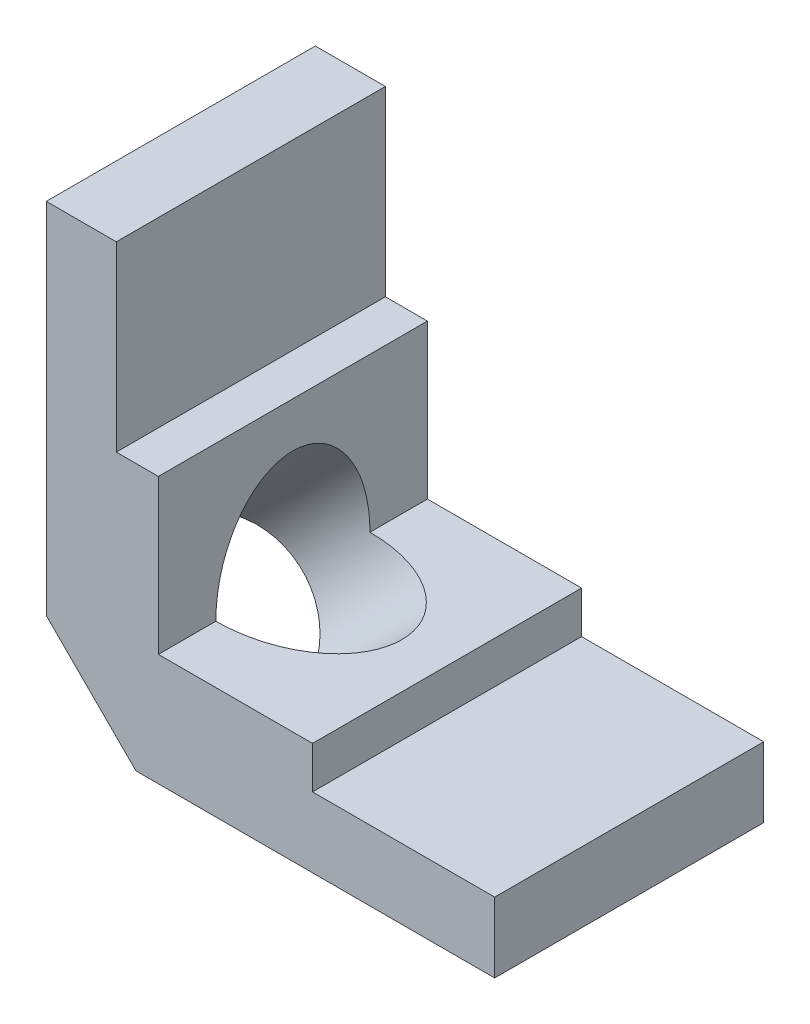
ISO-10303-21;
HEADER;
FILE_DESCRIPTION(('STEP AP214'),'2;1');
FILE_NAME('part.step','',(''),(''),'','','');
FILE_SCHEMA(('AUTOMOTIVE_DESIGN { 1 0 10303 214 1 1 1 1 }'));
ENDSEC;
DATA;
#1=APPLICATION_CONTEXT('core data for automotive mechanical design processes');
#2=APPLICATION_PROTOCOL_DEFINITION('international standard','automotive_design',2000,#1);
#3=PRODUCT_CONTEXT('',#1,'mechanical');
#4=PRODUCT('Part','Part','',(#3));
#5=PRODUCT_RELATED_PRODUCT_CATEGORY('part','',(#4));
#6=PRODUCT_DEFINITION_FORMATION('','',#4);
#7=PRODUCT_DEFINITION_CONTEXT('part definition',#1,'design');
#8=PRODUCT_DEFINITION('design','',#6,#7);
#9=PRODUCT_DEFINITION_SHAPE('','',#8);
#10=(LENGTH_UNIT() NAMED_UNIT(*) SI_UNIT(.MILLI.,.METRE.));
#11=(NAMED_UNIT(*) PLANE_ANGLE_UNIT() SI_UNIT($,.RADIAN.));
#12=(NAMED_UNIT(*) SI_UNIT($,.STERADIAN.) SOLID_ANGLE_UNIT());
#13=UNCERTAINTY_MEASURE_WITH_UNIT(LENGTH_MEASURE(1.E-05),#10,'distance_accuracy_value','');
#14=(GEOMETRIC_REPRESENTATION_CONTEXT(3) GLOBAL_UNCERTAINTY_ASSIGNED_CONTEXT((#13)) GLOBAL_UNIT_ASSIGNED_CONTEXT((#10,
#11,#12)) REPRESENTATION_CONTEXT('',''));
#15=CARTESIAN_POINT('',(0.,0.,0.));
#16=DIRECTION('',(0.,0.,1.));
#17=DIRECTION('',(1.,0.,0.));
#18=AXIS2_PLACEMENT_3D('',#15,#16,#17);
#19=CARTESIAN_POINT('',(5.07999999999997,0.,7.61999999999999));
#20=DIRECTION('',(0.707106781186549,0.707106781186546,0.));
#21=DIRECTION('',(-0.707106781186546,0.707106781186549,0.));
#22=AXIS2_PLACEMENT_3D('',#19,#20,#21);
#23=PLANE('',#22);
#24=CARTESIAN_POINT('',(2.53999999999998,2.54,0.));
#25=DIRECTION('',(0.707106781186549,0.707106781186546,0.));
#26=DIRECTION('',(-0.707106781186546,0.707106781186549,0.));
#27=AXIS2_PLACEMENT_3D('',#24,#25,#26);
#28=CIRCLE('',#27,4.36562499999999);
#29=CARTESIAN_POINT('',(0.,5.08000000000001,-2.48102431278391));
#30=VERTEX_POINT('',#29);
#31=CARTESIAN_POINT('',(5.07999999999997,0.,-2.48102431278394));
#32=VERTEX_POINT('',#31);
#33=EDGE_CURVE('E11',#30,#32,#28,.F.);
#34=ORIENTED_EDGE('',*,*,#33,.F.);
#35=DIRECTION('',(0.,0.,1.));
#36=VECTOR('',#35,1.);
#37=CARTESIAN_POINT('',(0.,5.08000000000002,7.62));
#38=LINE('',#37,#36);
#39=CARTESIAN_POINT('',(0.,5.08,-7.61999999999999));
#40=VERTEX_POINT('',#39);
#41=EDGE_CURVE('E145',#40,#30,#38,.T.);
#42=ORIENTED_EDGE('',*,*,#41,.F.);
#43=DIRECTION('',(0.707106781186546,-0.707106781186549,0.));
#44=VECTOR('',#43,1.);
#45=CARTESIAN_POINT('',(2.54,2.53999999999998,-7.62));
#46=LINE('',#45,#44);
#47=CARTESIAN_POINT('',(5.07999999999998,0.,-7.62));
#48=VERTEX_POINT('',#47);
#49=EDGE_CURVE('E149',#48,#40,#46,.F.);
#50=ORIENTED_EDGE('',*,*,#49,.F.);
#51=DIRECTION('',(0.,0.,-1.));
#52=VECTOR('',#51,1.);
#53=CARTESIAN_POINT('',(5.07999999999997,0.,7.61999999999999));
#54=LINE('',#53,#52);
#55=EDGE_CURVE('E169',#32,#48,#54,.T.);
#56=ORIENTED_EDGE('',*,*,#55,.F.);
#57=EDGE_LOOP('',(#34,#42,#50,#56));
#58=FACE_BOUND('',#57,.T.);
#59=ADVANCED_FACE('F30',(#58),#23,.F.);
#60=CARTESIAN_POINT('',(0.,25.4,7.62000000000002));
#61=DIRECTION('',(0.,-1.,0.));
#62=DIRECTION('',(0.,0.,-1.));
#63=AXIS2_PLACEMENT_3D('',#60,#61,#62);
#64=PLANE('',#63);
#65=DIRECTION('',(0.,0.,1.));
#66=VECTOR('',#65,1.);
#67=CARTESIAN_POINT('',(3.96874999999998,25.4,7.62000000000002));
#68=LINE('',#67,#66);
#69=CARTESIAN_POINT('',(3.96875,25.4,-7.61999999999998));
#70=VERTEX_POINT('',#69);
#71=CARTESIAN_POINT('',(3.96874999999998,25.4,7.62000000000002));
#72=VERTEX_POINT('',#71);
#73=EDGE_CURVE('E205',#70,#72,#68,.T.);
#74=ORIENTED_EDGE('',*,*,#73,.F.);
#75=DIRECTION('',(-1.,0.,0.));
#76=VECTOR('',#75,1.);
#77=CARTESIAN_POINT('',(0.,25.4,-7.61999999999997));
#78=LINE('',#77,#76);
#79=CARTESIAN_POINT('',(0.,25.4,-7.61999999999997));
#80=VERTEX_POINT('',#79);
#81=EDGE_CURVE('E180',#70,#80,#78,.T.);
#82=ORIENTED_EDGE('',*,*,#81,.T.);
#83=DIRECTION('',(0.,0.,-1.));
#84=VECTOR('',#83,1.);
#85=CARTESIAN_POINT('',(0.,25.4,7.62000000000002));
#86=LINE('',#85,#84);
#87=CARTESIAN_POINT('',(0.,25.4,7.62000000000002));
#88=VERTEX_POINT('',#87);
#89=EDGE_CURVE('E176',#88,#80,#86,.T.);
#90=ORIENTED_EDGE('',*,*,#89,.F.);
#91=DIRECTION('',(-1.,0.,0.));
#92=VECTOR('',#91,1.);
#93=CARTESIAN_POINT('',(0.,25.4,7.62000000000002));
#94=LINE('',#93,#92);
#95=EDGE_CURVE('E195',#72,#88,#94,.T.);
#96=ORIENTED_EDGE('',*,*,#95,.F.);
#97=EDGE_LOOP('',(#74,#82,#90,#96));
#98=FACE_BOUND('',#97,.T.);
#99=ADVANCED_FACE('F275',(#98),#64,.F.);
#100=CARTESIAN_POINT('',(25.4,0.,7.61999999999998));
#101=DIRECTION('',(0.,1.,0.));
#102=DIRECTION('',(-1.,0.,0.));
#103=AXIS2_PLACEMENT_3D('',#100,#101,#102);
#104=PLANE('',#103);
#105=CARTESIAN_POINT('',(5.07999999999997,0.,7.61999999999999));
#106=VERTEX_POINT('',#105);
#107=CARTESIAN_POINT('',(5.07999999999997,0.,2.48102431278393));
#108=VERTEX_POINT('',#107);
#109=EDGE_CURVE('E151',#106,#108,#54,.T.);
#110=ORIENTED_EDGE('',*,*,#109,.T.);
#111=CARTESIAN_POINT('',(0.,0.,0.));
#112=DIRECTION('',(0.,1.,0.));
#113=DIRECTION('',(-1.,0.,0.));
#114=AXIS2_PLACEMENT_3D('',#111,#112,#113);
#115=ELLIPSE('',#114,6.17392608323505,4.36562499999999);
#116=EDGE_CURVE('E51',#108,#32,#115,.T.);
#117=ORIENTED_EDGE('',*,*,#116,.T.);
#118=ORIENTED_EDGE('',*,*,#55,.T.);
#119=DIRECTION('',(1.,0.,0.));
#120=VECTOR('',#119,1.);
#121=CARTESIAN_POINT('',(25.4,0.,-7.62000000000002));
#122=LINE('',#121,#120);
#123=CARTESIAN_POINT('',(25.4,0.,-7.62000000000002));
#124=VERTEX_POINT('',#123);
#125=EDGE_CURVE('E191',#48,#124,#122,.T.);
#126=ORIENTED_EDGE('',*,*,#125,.T.);
#127=DIRECTION('',(0.,0.,-1.));
#128=VECTOR('',#127,1.);
#129=CARTESIAN_POINT('',(25.4,0.,7.61999999999998));
#130=LINE('',#129,#128);
#131=CARTESIAN_POINT('',(25.4,0.,7.61999999999998));
#132=VERTEX_POINT('',#131);
#133=EDGE_CURVE('E165',#132,#124,#130,.T.);
#134=ORIENTED_EDGE('',*,*,#133,.F.);
#135=DIRECTION('',(1.,0.,0.));
#136=VECTOR('',#135,1.);
#137=CARTESIAN_POINT('',(25.4,0.,7.61999999999998));
#138=LINE('',#137,#136);
#139=EDGE_CURVE('E158',#106,#132,#138,.T.);
#140=ORIENTED_EDGE('',*,*,#139,.F.);
#141=EDGE_LOOP('',(#110,#117,#118,#126,#134,#140));
#142=FACE_BOUND('',#141,.T.);
#143=ADVANCED_FACE('F163',(#142),#104,.F.);
#144=CARTESIAN_POINT('',(25.4,6.35000000000002,7.61999999999998));
#145=DIRECTION('',(-1.,0.,0.));
#146=DIRECTION('',(0.,0.,1.));
#147=AXIS2_PLACEMENT_3D('',#144,#145,#146);
#148=PLANE('',#147);
#149=DIRECTION('',(0.,1.,0.));
#150=VECTOR('',#149,1.);
#151=CARTESIAN_POINT('',(25.4,6.35,-7.62000000000002));
#152=LINE('',#151,#150);
#153=CARTESIAN_POINT('',(25.4,3.96875,-7.62000000000002));
#154=VERTEX_POINT('',#153);
#155=EDGE_CURVE('E188',#124,#154,#152,.T.);
#156=ORIENTED_EDGE('',*,*,#155,.T.);
#157=DIRECTION('',(0.,0.,-1.));
#158=VECTOR('',#157,1.);
#159=CARTESIAN_POINT('',(25.4,3.96875000000002,7.61999999999998));
#160=LINE('',#159,#158);
#161=CARTESIAN_POINT('',(25.4,3.96875000000002,7.61999999999998));
#162=VERTEX_POINT('',#161);
#163=EDGE_CURVE('E229',#162,#154,#160,.T.);
#164=ORIENTED_EDGE('',*,*,#163,.F.);
#165=DIRECTION('',(0.,1.,0.));
#166=VECTOR('',#165,1.);
#167=CARTESIAN_POINT('',(25.4,6.35000000000002,7.61999999999998));
#168=LINE('',#167,#166);
#169=EDGE_CURVE('E166',#132,#162,#168,.T.);
#170=ORIENTED_EDGE('',*,*,#169,.F.);
#171=ORIENTED_EDGE('',*,*,#133,.T.);
#172=EDGE_LOOP('',(#156,#164,#170,#171));
#173=FACE_BOUND('',#172,.T.);
#174=ADVANCED_FACE('F267',(#173),#148,.F.);
#175=CARTESIAN_POINT('',(6.34999999999998,6.35000000000001,7.62));
#176=DIRECTION('',(0.,-1.,0.));
#177=DIRECTION('',(1.,0.,0.));
#178=AXIS2_PLACEMENT_3D('',#175,#176,#177);
#179=PLANE('',#178);
#180=DIRECTION('',(0.,0.,-1.));
#181=VECTOR('',#180,1.);
#182=CARTESIAN_POINT('',(6.34999999999998,6.35000000000001,7.62));
#183=LINE('',#182,#181);
#184=CARTESIAN_POINT('',(6.35,6.35,-4.36562499999999));
#185=VERTEX_POINT('',#184);
#186=CARTESIAN_POINT('',(6.35,6.34999999999999,-7.62));
#187=VERTEX_POINT('',#186);
#188=EDGE_CURVE('E175',#185,#187,#183,.T.);
#189=ORIENTED_EDGE('',*,*,#188,.F.);
#190=CARTESIAN_POINT('',(6.35,6.35,0.));
#191=DIRECTION('',(0.,-1.,0.));
#192=DIRECTION('',(-1.,0.,0.));
#193=AXIS2_PLACEMENT_3D('',#190,#191,#192);
#194=ELLIPSE('',#193,6.17392608323505,4.36562499999999);
#195=CARTESIAN_POINT('',(6.34999999999998,6.35,4.365625));
#196=VERTEX_POINT('',#195);
#197=EDGE_CURVE('E44',#185,#196,#194,.T.);
#198=ORIENTED_EDGE('',*,*,#197,.T.);
#199=CARTESIAN_POINT('',(6.34999999999998,6.35000000000001,7.62));
#200=VERTEX_POINT('',#199);
#201=EDGE_CURVE('E172',#200,#196,#183,.T.);
#202=ORIENTED_EDGE('',*,*,#201,.F.);
#203=DIRECTION('',(-1.,0.,0.));
#204=VECTOR('',#203,1.);
#205=CARTESIAN_POINT('',(6.34999999999998,6.35000000000001,7.62));
#206=LINE('',#205,#204);
#207=CARTESIAN_POINT('',(15.08125,6.35000000000002,7.61999999999999));
#208=VERTEX_POINT('',#207);
#209=EDGE_CURVE('E200',#208,#200,#206,.T.);
#210=ORIENTED_EDGE('',*,*,#209,.F.);
#211=DIRECTION('',(0.,0.,1.));
#212=VECTOR('',#211,1.);
#213=CARTESIAN_POINT('',(15.08125,6.35000000000002,7.61999999999999));
#214=LINE('',#213,#212);
#215=CARTESIAN_POINT('',(15.08125,6.35,-7.62000000000001));
#216=VERTEX_POINT('',#215);
#217=EDGE_CURVE('E224',#216,#208,#214,.T.);
#218=ORIENTED_EDGE('',*,*,#217,.F.);
#219=DIRECTION('',(-1.,0.,0.));
#220=VECTOR('',#219,1.);
#221=CARTESIAN_POINT('',(6.35,6.34999999999999,-7.62));
#222=LINE('',#221,#220);
#223=EDGE_CURVE('E185',#216,#187,#222,.T.);
#224=ORIENTED_EDGE('',*,*,#223,.T.);
#225=EDGE_LOOP('',(#189,#198,#202,#210,#218,#224));
#226=FACE_BOUND('',#225,.T.);
#227=ADVANCED_FACE('F243',(#226),#179,.F.);
#228=CARTESIAN_POINT('',(6.34999999999998,25.4,7.62000000000002));
#229=DIRECTION('',(-1.,0.,0.));
#230=DIRECTION('',(0.,-1.,0.));
#231=AXIS2_PLACEMENT_3D('',#228,#229,#230);
#232=PLANE('',#231);
#233=ORIENTED_EDGE('',*,*,#201,.T.);
#234=CARTESIAN_POINT('',(6.35,6.34999999999999,0.));
#235=DIRECTION('',(-1.,0.,0.));
#236=DIRECTION('',(0.,-1.,0.));
#237=AXIS2_PLACEMENT_3D('',#234,#235,#236);
#238=ELLIPSE('',#237,6.17392608323502,4.36562499999999);
#239=EDGE_CURVE('E146',#196,#185,#238,.T.);
#240=ORIENTED_EDGE('',*,*,#239,.T.);
#241=ORIENTED_EDGE('',*,*,#188,.T.);
#242=DIRECTION('',(0.,1.,0.));
#243=VECTOR('',#242,1.);
#244=CARTESIAN_POINT('',(6.35,25.4,-7.61999999999998));
#245=LINE('',#244,#243);
#246=CARTESIAN_POINT('',(6.35,15.08125,-7.61999999999999));
#247=VERTEX_POINT('',#246);
#248=EDGE_CURVE('E182',#187,#247,#245,.T.);
#249=ORIENTED_EDGE('',*,*,#248,.T.);
#250=DIRECTION('',(0.,0.,-1.));
#251=VECTOR('',#250,1.);
#252=CARTESIAN_POINT('',(6.34999999999998,15.08125,7.62000000000001));
#253=LINE('',#252,#251);
#254=CARTESIAN_POINT('',(6.34999999999998,15.08125,7.62000000000001));
#255=VERTEX_POINT('',#254);
#256=EDGE_CURVE('E208',#255,#247,#253,.T.);
#257=ORIENTED_EDGE('',*,*,#256,.F.);
#258=DIRECTION('',(0.,1.,0.));
#259=VECTOR('',#258,1.);
#260=CARTESIAN_POINT('',(6.34999999999998,25.4,7.62000000000002));
#261=LINE('',#260,#259);
#262=EDGE_CURVE('E197',#200,#255,#261,.T.);
#263=ORIENTED_EDGE('',*,*,#262,.F.);
#264=EDGE_LOOP('',(#233,#240,#241,#249,#257,#263));
#265=FACE_BOUND('',#264,.T.);
#266=ADVANCED_FACE('F239',(#265),#232,.F.);
#267=CARTESIAN_POINT('',(0.,0.,7.62));
#268=DIRECTION('',(1.,0.,0.));
#269=DIRECTION('',(0.,0.,-1.));
#270=AXIS2_PLACEMENT_3D('',#267,#268,#269);
#271=PLANE('',#270);
#272=ORIENTED_EDGE('',*,*,#41,.T.);
#273=CARTESIAN_POINT('',(0.,0.,0.));
#274=DIRECTION('',(1.,0.,0.));
#275=DIRECTION('',(0.,-1.,0.));
#276=AXIS2_PLACEMENT_3D('',#273,#274,#275);
#277=ELLIPSE('',#276,6.17392608323502,4.36562499999999);
#278=CARTESIAN_POINT('',(0.,5.08000000000001,2.48102431278392));
#279=VERTEX_POINT('',#278);
#280=EDGE_CURVE('E130',#30,#279,#277,.T.);
#281=ORIENTED_EDGE('',*,*,#280,.T.);
#282=CARTESIAN_POINT('',(0.,5.08000000000002,7.62));
#283=VERTEX_POINT('',#282);
#284=EDGE_CURVE('E141',#279,#283,#38,.T.);
#285=ORIENTED_EDGE('',*,*,#284,.T.);
#286=DIRECTION('',(0.,-1.,0.));
#287=VECTOR('',#286,1.);
#288=CARTESIAN_POINT('',(0.,0.,7.62));
#289=LINE('',#288,#287);
#290=EDGE_CURVE('E160',#88,#283,#289,.T.);
#291=ORIENTED_EDGE('',*,*,#290,.F.);
#292=ORIENTED_EDGE('',*,*,#89,.T.);
#293=DIRECTION('',(0.,-1.,0.));
#294=VECTOR('',#293,1.);
#295=CARTESIAN_POINT('',(0.,0.,-7.62));
#296=LINE('',#295,#294);
#297=EDGE_CURVE('E167',#80,#40,#296,.T.);
#298=ORIENTED_EDGE('',*,*,#297,.T.);
#299=EDGE_LOOP('',(#272,#281,#285,#291,#292,#298));
#300=FACE_BOUND('',#299,.T.);
#301=ADVANCED_FACE('F139',(#300),#271,.F.);
#302=CARTESIAN_POINT('',(0.,0.,7.62));
#303=DIRECTION('',(0.,0.,-1.));
#304=DIRECTION('',(-1.,0.,0.));
#305=AXIS2_PLACEMENT_3D('',#302,#303,#304);
#306=PLANE('',#305);
#307=ORIENTED_EDGE('',*,*,#290,.T.);
#308=DIRECTION('',(-0.707106781186546,0.707106781186549,0.));
#309=VECTOR('',#308,1.);
#310=CARTESIAN_POINT('',(5.07999999999997,0.,7.61999999999999));
#311=LINE('',#310,#309);
#312=EDGE_CURVE('E38',#283,#106,#311,.F.);
#313=ORIENTED_EDGE('',*,*,#312,.T.);
#314=ORIENTED_EDGE('',*,*,#139,.T.);
#315=ORIENTED_EDGE('',*,*,#169,.T.);
#316=DIRECTION('',(1.,0.,0.));
#317=VECTOR('',#316,1.);
#318=CARTESIAN_POINT('',(15.08125,3.96875000000002,7.61999999999999));
#319=LINE('',#318,#317);
#320=CARTESIAN_POINT('',(15.08125,3.96875000000002,7.61999999999999));
#321=VERTEX_POINT('',#320);
#322=EDGE_CURVE('E231',#321,#162,#319,.T.);
#323=ORIENTED_EDGE('',*,*,#322,.F.);
#324=DIRECTION('',(0.,1.,0.));
#325=VECTOR('',#324,1.);
#326=CARTESIAN_POINT('',(15.08125,3.96875000000002,7.61999999999999));
#327=LINE('',#326,#325);
#328=EDGE_CURVE('E219',#321,#208,#327,.T.);
#329=ORIENTED_EDGE('',*,*,#328,.T.);
#330=ORIENTED_EDGE('',*,*,#209,.T.);
#331=ORIENTED_EDGE('',*,*,#262,.T.);
#332=DIRECTION('',(1.,0.,0.));
#333=VECTOR('',#332,1.);
#334=CARTESIAN_POINT('',(3.96874999999998,15.08125,7.62000000000001));
#335=LINE('',#334,#333);
#336=CARTESIAN_POINT('',(3.96874999999998,15.08125,7.62000000000001));
#337=VERTEX_POINT('',#336);
#338=EDGE_CURVE('E203',#337,#255,#335,.T.);
#339=ORIENTED_EDGE('',*,*,#338,.F.);
#340=DIRECTION('',(0.,-1.,0.));
#341=VECTOR('',#340,1.);
#342=CARTESIAN_POINT('',(3.96874999999998,25.4,7.62000000000002));
#343=LINE('',#342,#341);
#344=EDGE_CURVE('E210',#72,#337,#343,.T.);
#345=ORIENTED_EDGE('',*,*,#344,.F.);
#346=ORIENTED_EDGE('',*,*,#95,.T.);
#347=EDGE_LOOP('',(#307,#313,#314,#315,#323,#329,#330,#331,#339,#345,#346));
#348=FACE_BOUND('',#347,.T.);
#349=ADVANCED_FACE('F156',(#348),#306,.F.);
#350=CARTESIAN_POINT('',(0.,0.,-7.62));
#351=DIRECTION('',(0.,0.,-1.));
#352=DIRECTION('',(-1.,0.,0.));
#353=AXIS2_PLACEMENT_3D('',#350,#351,#352);
#354=PLANE('',#353);
#355=ORIENTED_EDGE('',*,*,#125,.F.);
#356=ORIENTED_EDGE('',*,*,#49,.T.);
#357=ORIENTED_EDGE('',*,*,#297,.F.);
#358=ORIENTED_EDGE('',*,*,#81,.F.);
#359=DIRECTION('',(0.,1.,0.));
#360=VECTOR('',#359,1.);
#361=CARTESIAN_POINT('',(3.96875,25.4,-7.61999999999998));
#362=LINE('',#361,#360);
#363=CARTESIAN_POINT('',(3.96875,15.08125,-7.61999999999999));
#364=VERTEX_POINT('',#363);
#365=EDGE_CURVE('E213',#364,#70,#362,.T.);
#366=ORIENTED_EDGE('',*,*,#365,.F.);
#367=DIRECTION('',(1.,0.,0.));
#368=VECTOR('',#367,1.);
#369=CARTESIAN_POINT('',(3.96875,15.08125,-7.61999999999999));
#370=LINE('',#369,#368);
#371=EDGE_CURVE('E193',#364,#247,#370,.T.);
#372=ORIENTED_EDGE('',*,*,#371,.T.);
#373=ORIENTED_EDGE('',*,*,#248,.F.);
#374=ORIENTED_EDGE('',*,*,#223,.F.);
#375=DIRECTION('',(0.,1.,0.));
#376=VECTOR('',#375,1.);
#377=CARTESIAN_POINT('',(15.08125,3.96875,-7.62000000000001));
#378=LINE('',#377,#376);
#379=CARTESIAN_POINT('',(15.08125,3.96875,-7.62000000000001));
#380=VERTEX_POINT('',#379);
#381=EDGE_CURVE('E211',#380,#216,#378,.T.);
#382=ORIENTED_EDGE('',*,*,#381,.F.);
#383=DIRECTION('',(-1.,0.,0.));
#384=VECTOR('',#383,1.);
#385=CARTESIAN_POINT('',(15.08125,3.96875,-7.62000000000001));
#386=LINE('',#385,#384);
#387=EDGE_CURVE('E222',#154,#380,#386,.T.);
#388=ORIENTED_EDGE('',*,*,#387,.F.);
#389=ORIENTED_EDGE('',*,*,#155,.F.);
#390=EDGE_LOOP('',(#355,#356,#357,#358,#366,#372,#373,#374,#382,#388,#389));
#391=FACE_BOUND('',#390,.T.);
#392=ADVANCED_FACE('F251',(#391),#354,.T.);
#393=CARTESIAN_POINT('',(3.96874999999998,15.08125,7.62000000000001));
#394=DIRECTION('',(0.,-1.,0.));
#395=DIRECTION('',(1.,0.,0.));
#396=AXIS2_PLACEMENT_3D('',#393,#394,#395);
#397=PLANE('',#396);
#398=ORIENTED_EDGE('',*,*,#256,.T.);
#399=ORIENTED_EDGE('',*,*,#371,.F.);
#400=DIRECTION('',(0.,0.,-1.));
#401=VECTOR('',#400,1.);
#402=CARTESIAN_POINT('',(3.96874999999998,15.08125,7.62000000000001));
#403=LINE('',#402,#401);
#404=EDGE_CURVE('E215',#337,#364,#403,.T.);
#405=ORIENTED_EDGE('',*,*,#404,.F.);
#406=ORIENTED_EDGE('',*,*,#338,.T.);
#407=EDGE_LOOP('',(#398,#399,#405,#406));
#408=FACE_BOUND('',#407,.T.);
#409=ADVANCED_FACE('F298',(#408),#397,.F.);
#410=CARTESIAN_POINT('',(3.96874999999998,15.08125,7.62000000000001));
#411=DIRECTION('',(1.,0.,0.));
#412=DIRECTION('',(0.,1.,0.));
#413=AXIS2_PLACEMENT_3D('',#410,#411,#412);
#414=PLANE('',#413);
#415=ORIENTED_EDGE('',*,*,#344,.T.);
#416=ORIENTED_EDGE('',*,*,#404,.T.);
#417=ORIENTED_EDGE('',*,*,#365,.T.);
#418=ORIENTED_EDGE('',*,*,#73,.T.);
#419=EDGE_LOOP('',(#415,#416,#417,#418));
#420=FACE_BOUND('',#419,.T.);
#421=ADVANCED_FACE('F293',(#420),#414,.T.);
#422=CARTESIAN_POINT('',(15.08125,3.96875000000002,7.61999999999999));
#423=DIRECTION('',(-1.,0.,0.));
#424=DIRECTION('',(0.,0.,1.));
#425=AXIS2_PLACEMENT_3D('',#422,#423,#424);
#426=PLANE('',#425);
#427=ORIENTED_EDGE('',*,*,#217,.T.);
#428=ORIENTED_EDGE('',*,*,#328,.F.);
#429=DIRECTION('',(0.,0.,1.));
#430=VECTOR('',#429,1.);
#431=CARTESIAN_POINT('',(15.08125,3.96875000000002,7.61999999999999));
#432=LINE('',#431,#430);
#433=EDGE_CURVE('E226',#380,#321,#432,.T.);
#434=ORIENTED_EDGE('',*,*,#433,.F.);
#435=ORIENTED_EDGE('',*,*,#381,.T.);
#436=EDGE_LOOP('',(#427,#428,#434,#435));
#437=FACE_BOUND('',#436,.T.);
#438=ADVANCED_FACE('F260',(#437),#426,.F.);
#439=CARTESIAN_POINT('',(15.08125,3.96875,-7.62000000000001));
#440=DIRECTION('',(0.,-1.,0.));
#441=DIRECTION('',(0.,0.,-1.));
#442=AXIS2_PLACEMENT_3D('',#439,#440,#441);
#443=PLANE('',#442);
#444=ORIENTED_EDGE('',*,*,#433,.T.);
#445=ORIENTED_EDGE('',*,*,#322,.T.);
#446=ORIENTED_EDGE('',*,*,#163,.T.);
#447=ORIENTED_EDGE('',*,*,#387,.T.);
#448=EDGE_LOOP('',(#444,#445,#446,#447));
#449=FACE_BOUND('',#448,.T.);
#450=ADVANCED_FACE('F262',(#449),#443,.F.);
#451=CARTESIAN_POINT('',(2.53999999999998,2.54,0.));
#452=DIRECTION('',(-0.707106781186549,-0.707106781186546,0.));
#453=DIRECTION('',(0.707106781186546,-0.707106781186549,0.));
#454=AXIS2_PLACEMENT_3D('',#451,#452,#453);
#455=CIRCLE('',#454,4.365625);
#456=EDGE_CURVE('E127',#108,#279,#455,.T.);
#457=ORIENTED_EDGE('',*,*,#456,.F.);
#458=ORIENTED_EDGE('',*,*,#109,.F.);
#459=ORIENTED_EDGE('',*,*,#312,.F.);
#460=ORIENTED_EDGE('',*,*,#284,.F.);
#461=EDGE_LOOP('',(#457,#458,#459,#460));
#462=FACE_BOUND('',#461,.T.);
#463=ADVANCED_FACE('F32',(#462),#23,.F.);
#464=CARTESIAN_POINT('',(2.53999999999998,2.54,0.));
#465=DIRECTION('',(-0.707106781186549,-0.707106781186546,0.));
#466=DIRECTION('',(0.707106781186546,-0.707106781186549,0.));
#467=AXIS2_PLACEMENT_3D('',#464,#465,#466);
#468=CYLINDRICAL_SURFACE('',#467,4.36562499999999);
#469=ORIENTED_EDGE('',*,*,#239,.F.);
#470=ORIENTED_EDGE('',*,*,#197,.F.);
#471=EDGE_LOOP('',(#469,#470));
#472=FACE_BOUND('',#471,.T.);
#473=ORIENTED_EDGE('',*,*,#456,.T.);
#474=ORIENTED_EDGE('',*,*,#280,.F.);
#475=ORIENTED_EDGE('',*,*,#33,.T.);
#476=ORIENTED_EDGE('',*,*,#116,.F.);
#477=EDGE_LOOP('',(#473,#474,#475,#476));
#478=FACE_BOUND('',#477,.T.);
#479=ADVANCED_FACE('F129',(#472,#478),#468,.F.);
#480=CLOSED_SHELL('',(#59,#99,#143,#174,#227,#266,#301,#349,#392,#409,#421,#438,#450,#463,#479));
#481=MANIFOLD_SOLID_BREP('B2',#480);
#482=ADVANCED_BREP_SHAPE_REPRESENTATION('',(#18,#481),#14);
#483=SHAPE_DEFINITION_REPRESENTATION(#9,#482);
ENDSEC;
END-ISO-10303-21;
